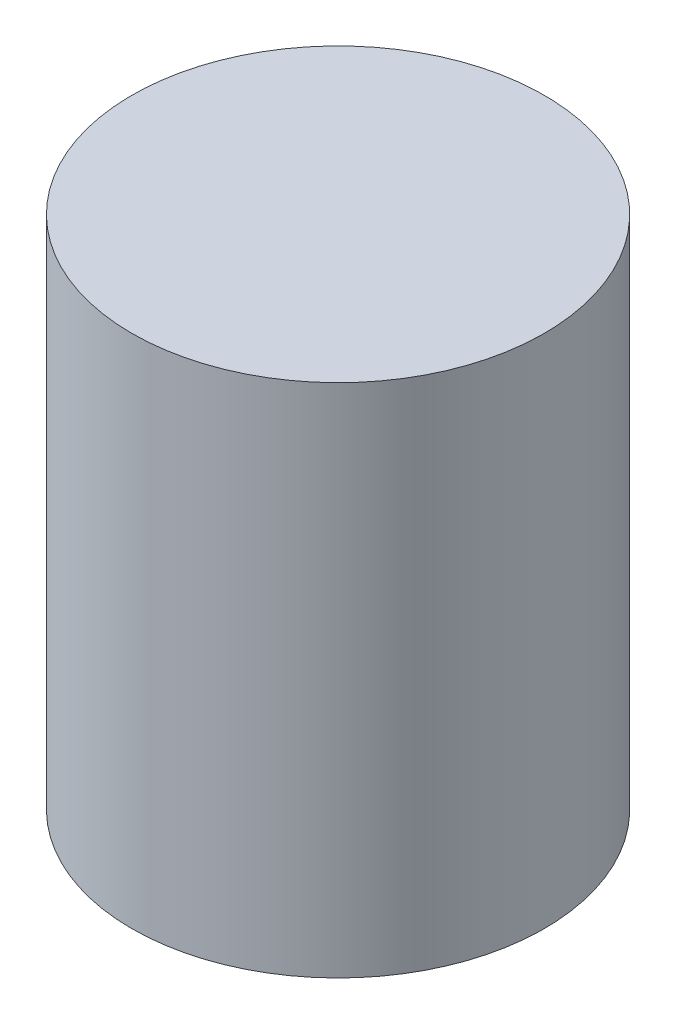
ISO-10303-21;
HEADER;
FILE_DESCRIPTION(('STEP AP214'),'2;1');
FILE_NAME('part.step','',(''),(''),'','','');
FILE_SCHEMA(('AUTOMOTIVE_DESIGN { 1 0 10303 214 1 1 1 1 }'));
ENDSEC;
DATA;
#1=APPLICATION_CONTEXT('core data for automotive mechanical design processes');
#2=APPLICATION_PROTOCOL_DEFINITION('international standard','automotive_design',2000,#1);
#3=PRODUCT_CONTEXT('',#1,'mechanical');
#4=PRODUCT('Part','Part','',(#3));
#5=PRODUCT_RELATED_PRODUCT_CATEGORY('part','',(#4));
#6=PRODUCT_DEFINITION_FORMATION('','',#4);
#7=PRODUCT_DEFINITION_CONTEXT('part definition',#1,'design');
#8=PRODUCT_DEFINITION('design','',#6,#7);
#9=PRODUCT_DEFINITION_SHAPE('','',#8);
#10=(LENGTH_UNIT() NAMED_UNIT(*) SI_UNIT(.MILLI.,.METRE.));
#11=(NAMED_UNIT(*) PLANE_ANGLE_UNIT() SI_UNIT($,.RADIAN.));
#12=(NAMED_UNIT(*) SI_UNIT($,.STERADIAN.) SOLID_ANGLE_UNIT());
#13=UNCERTAINTY_MEASURE_WITH_UNIT(LENGTH_MEASURE(1.E-05),#10,'distance_accuracy_value','');
#14=(GEOMETRIC_REPRESENTATION_CONTEXT(3) GLOBAL_UNCERTAINTY_ASSIGNED_CONTEXT((#13)) GLOBAL_UNIT_ASSIGNED_CONTEXT((#10,
#11,#12)) REPRESENTATION_CONTEXT('',''));
#15=CARTESIAN_POINT('',(0.,0.,0.));
#16=DIRECTION('',(0.,0.,1.));
#17=DIRECTION('',(1.,0.,0.));
#18=AXIS2_PLACEMENT_3D('',#15,#16,#17);
#19=CARTESIAN_POINT('',(0.,50.,0.));
#20=DIRECTION('',(0.,-1.,0.));
#21=DIRECTION('',(0.,0.,-1.));
#22=AXIS2_PLACEMENT_3D('',#19,#20,#21);
#23=CYLINDRICAL_SURFACE('',#22,20.);
#24=CARTESIAN_POINT('',(0.,50.,0.));
#25=DIRECTION('',(0.,1.,0.));
#26=DIRECTION('',(0.,0.,1.));
#27=AXIS2_PLACEMENT_3D('',#24,#25,#26);
#28=CIRCLE('',#27,20.);
#29=CARTESIAN_POINT('',(0.,50.,20.));
#30=VERTEX_POINT('',#29);
#31=EDGE_CURVE('E10',#30,#30,#28,.T.);
#32=ORIENTED_EDGE('',*,*,#31,.F.);
#33=EDGE_LOOP('',(#32));
#34=FACE_BOUND('',#33,.T.);
#35=CARTESIAN_POINT('',(0.,0.,0.));
#36=DIRECTION('',(0.,1.,0.));
#37=DIRECTION('',(0.,0.,1.));
#38=AXIS2_PLACEMENT_3D('',#35,#36,#37);
#39=CIRCLE('',#38,20.);
#40=CARTESIAN_POINT('',(0.,0.,20.));
#41=VERTEX_POINT('',#40);
#42=EDGE_CURVE('E44',#41,#41,#39,.T.);
#43=ORIENTED_EDGE('',*,*,#42,.T.);
#44=EDGE_LOOP('',(#43));
#45=FACE_BOUND('',#44,.T.);
#46=ADVANCED_FACE('F41',(#34,#45),#23,.T.);
#47=CARTESIAN_POINT('',(0.,50.,0.));
#48=DIRECTION('',(0.,1.,0.));
#49=DIRECTION('',(0.,0.,1.));
#50=AXIS2_PLACEMENT_3D('',#47,#48,#49);
#51=PLANE('',#50);
#52=ORIENTED_EDGE('',*,*,#31,.T.);
#53=EDGE_LOOP('',(#52));
#54=FACE_BOUND('',#53,.T.);
#55=ADVANCED_FACE('F56',(#54),#51,.T.);
#56=CARTESIAN_POINT('',(0.,0.,0.));
#57=DIRECTION('',(0.,1.,0.));
#58=DIRECTION('',(0.,0.,1.));
#59=AXIS2_PLACEMENT_3D('',#56,#57,#58);
#60=PLANE('',#59);
#61=ORIENTED_EDGE('',*,*,#42,.F.);
#62=EDGE_LOOP('',(#61));
#63=FACE_BOUND('',#62,.T.);
#64=ADVANCED_FACE('F54',(#63),#60,.F.);
#65=CLOSED_SHELL('',(#46,#55,#64));
#66=MANIFOLD_SOLID_BREP('B2',#65);
#67=ADVANCED_BREP_SHAPE_REPRESENTATION('',(#18,#66),#14);
#68=SHAPE_DEFINITION_REPRESENTATION(#9,#67);
ENDSEC;
END-ISO-10303-21;
